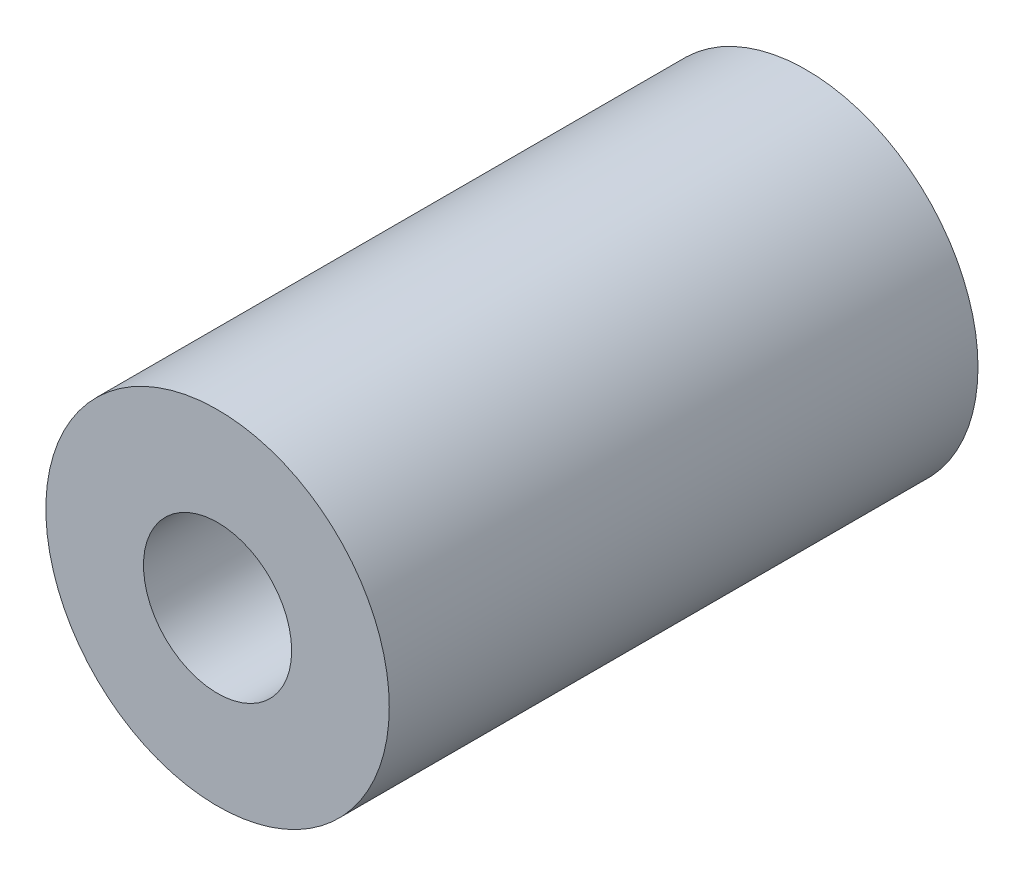
ISO-10303-21;
HEADER;
FILE_DESCRIPTION(('STEP AP214'),'2;1');
FILE_NAME('part.step','',(''),(''),'','','');
FILE_SCHEMA(('AUTOMOTIVE_DESIGN { 1 0 10303 214 1 1 1 1 }'));
ENDSEC;
DATA;
#1=APPLICATION_CONTEXT('core data for automotive mechanical design processes');
#2=APPLICATION_PROTOCOL_DEFINITION('international standard','automotive_design',2000,#1);
#3=PRODUCT_CONTEXT('',#1,'mechanical');
#4=PRODUCT('Part','Part','',(#3));
#5=PRODUCT_RELATED_PRODUCT_CATEGORY('part','',(#4));
#6=PRODUCT_DEFINITION_FORMATION('','',#4);
#7=PRODUCT_DEFINITION_CONTEXT('part definition',#1,'design');
#8=PRODUCT_DEFINITION('design','',#6,#7);
#9=PRODUCT_DEFINITION_SHAPE('','',#8);
#10=(LENGTH_UNIT() NAMED_UNIT(*) SI_UNIT(.MILLI.,.METRE.));
#11=(NAMED_UNIT(*) PLANE_ANGLE_UNIT() SI_UNIT($,.RADIAN.));
#12=(NAMED_UNIT(*) SI_UNIT($,.STERADIAN.) SOLID_ANGLE_UNIT());
#13=UNCERTAINTY_MEASURE_WITH_UNIT(LENGTH_MEASURE(1.E-05),#10,'distance_accuracy_value','');
#14=(GEOMETRIC_REPRESENTATION_CONTEXT(3) GLOBAL_UNCERTAINTY_ASSIGNED_CONTEXT((#13)) GLOBAL_UNIT_ASSIGNED_CONTEXT((#10,
#11,#12)) REPRESENTATION_CONTEXT('',''));
#15=CARTESIAN_POINT('',(0.,0.,0.));
#16=DIRECTION('',(0.,0.,1.));
#17=DIRECTION('',(1.,0.,0.));
#18=AXIS2_PLACEMENT_3D('',#15,#16,#17);
#19=CARTESIAN_POINT('',(0.,0.,30.));
#20=DIRECTION('',(0.,0.,-1.));
#21=DIRECTION('',(-1.,0.,0.));
#22=AXIS2_PLACEMENT_3D('',#19,#20,#21);
#23=CYLINDRICAL_SURFACE('',#22,17.5);
#24=CARTESIAN_POINT('',(0.,0.,30.));
#25=DIRECTION('',(0.,0.,1.));
#26=DIRECTION('',(1.,0.,0.));
#27=AXIS2_PLACEMENT_3D('',#24,#25,#26);
#28=CIRCLE('',#27,17.5);
#29=CARTESIAN_POINT('',(17.5,0.,30.));
#30=VERTEX_POINT('',#29);
#31=EDGE_CURVE('E10',#30,#30,#28,.T.);
#32=ORIENTED_EDGE('',*,*,#31,.F.);
#33=EDGE_LOOP('',(#32));
#34=FACE_BOUND('',#33,.T.);
#35=CARTESIAN_POINT('',(0.,0.,-30.));
#36=DIRECTION('',(0.,0.,1.));
#37=DIRECTION('',(1.,0.,0.));
#38=AXIS2_PLACEMENT_3D('',#35,#36,#37);
#39=CIRCLE('',#38,17.5);
#40=CARTESIAN_POINT('',(17.5,0.,-30.));
#41=VERTEX_POINT('',#40);
#42=EDGE_CURVE('E34',#41,#41,#39,.T.);
#43=ORIENTED_EDGE('',*,*,#42,.T.);
#44=EDGE_LOOP('',(#43));
#45=FACE_BOUND('',#44,.T.);
#46=ADVANCED_FACE('F31',(#34,#45),#23,.T.);
#47=CARTESIAN_POINT('',(0.,0.,30.));
#48=DIRECTION('',(0.,0.,1.));
#49=DIRECTION('',(1.,0.,0.));
#50=AXIS2_PLACEMENT_3D('',#47,#48,#49);
#51=PLANE('',#50);
#52=CARTESIAN_POINT('',(0.,0.,30.));
#53=DIRECTION('',(0.,0.,1.));
#54=DIRECTION('',(1.,0.,0.));
#55=AXIS2_PLACEMENT_3D('',#52,#53,#54);
#56=CIRCLE('',#55,7.55);
#57=CARTESIAN_POINT('',(7.55,0.,30.));
#58=VERTEX_POINT('',#57);
#59=EDGE_CURVE('E41',#58,#58,#56,.T.);
#60=ORIENTED_EDGE('',*,*,#59,.F.);
#61=EDGE_LOOP('',(#60));
#62=FACE_BOUND('',#61,.T.);
#63=ORIENTED_EDGE('',*,*,#31,.T.);
#64=EDGE_LOOP('',(#63));
#65=FACE_BOUND('',#64,.T.);
#66=ADVANCED_FACE('F62',(#62,#65),#51,.T.);
#67=CARTESIAN_POINT('',(0.,0.,-30.));
#68=DIRECTION('',(0.,0.,1.));
#69=DIRECTION('',(1.,0.,0.));
#70=AXIS2_PLACEMENT_3D('',#67,#68,#69);
#71=PLANE('',#70);
#72=CARTESIAN_POINT('',(0.,0.,-30.));
#73=DIRECTION('',(0.,0.,-1.));
#74=DIRECTION('',(-1.,0.,0.));
#75=AXIS2_PLACEMENT_3D('',#72,#73,#74);
#76=CIRCLE('',#75,10.05);
#77=CARTESIAN_POINT('',(-10.05,0.,-30.));
#78=VERTEX_POINT('',#77);
#79=EDGE_CURVE('E51',#78,#78,#76,.T.);
#80=ORIENTED_EDGE('',*,*,#79,.F.);
#81=EDGE_LOOP('',(#80));
#82=FACE_BOUND('',#81,.T.);
#83=ORIENTED_EDGE('',*,*,#42,.F.);
#84=EDGE_LOOP('',(#83));
#85=FACE_BOUND('',#84,.T.);
#86=ADVANCED_FACE('F58',(#82,#85),#71,.F.);
#87=CARTESIAN_POINT('',(0.,0.,-21.3546247918337));
#88=DIRECTION('',(0.,0.,1.));
#89=DIRECTION('',(1.,0.,0.));
#90=AXIS2_PLACEMENT_3D('',#87,#88,#89);
#91=CYLINDRICAL_SURFACE('',#90,7.55);
#92=CARTESIAN_POINT('',(0.,0.,0.));
#93=DIRECTION('',(0.,0.,1.));
#94=DIRECTION('',(1.,0.,0.));
#95=AXIS2_PLACEMENT_3D('',#92,#93,#94);
#96=CIRCLE('',#95,7.55);
#97=CARTESIAN_POINT('',(7.55,0.,0.));
#98=VERTEX_POINT('',#97);
#99=EDGE_CURVE('E45',#98,#98,#96,.F.);
#100=ORIENTED_EDGE('',*,*,#99,.T.);
#101=EDGE_LOOP('',(#100));
#102=FACE_BOUND('',#101,.T.);
#103=ORIENTED_EDGE('',*,*,#59,.T.);
#104=EDGE_LOOP('',(#103));
#105=FACE_BOUND('',#104,.T.);
#106=ADVANCED_FACE('F61',(#102,#105),#91,.F.);
#107=CARTESIAN_POINT('',(0.,0.,0.));
#108=DIRECTION('',(0.,0.,1.));
#109=DIRECTION('',(1.,0.,0.));
#110=AXIS2_PLACEMENT_3D('',#107,#108,#109);
#111=PLANE('',#110);
#112=CARTESIAN_POINT('',(0.,0.,0.));
#113=DIRECTION('',(0.,0.,1.));
#114=DIRECTION('',(1.,0.,0.));
#115=AXIS2_PLACEMENT_3D('',#112,#113,#114);
#116=CIRCLE('',#115,10.05);
#117=CARTESIAN_POINT('',(10.05,0.,0.));
#118=VERTEX_POINT('',#117);
#119=EDGE_CURVE('E48',#118,#118,#116,.F.);
#120=ORIENTED_EDGE('',*,*,#119,.T.);
#121=EDGE_LOOP('',(#120));
#122=FACE_BOUND('',#121,.T.);
#123=ORIENTED_EDGE('',*,*,#99,.F.);
#124=EDGE_LOOP('',(#123));
#125=FACE_BOUND('',#124,.T.);
#126=ADVANCED_FACE('F78',(#122,#125),#111,.F.);
#127=CARTESIAN_POINT('',(0.,0.,28.4256926036992));
#128=DIRECTION('',(0.,0.,-1.));
#129=DIRECTION('',(-1.,0.,0.));
#130=AXIS2_PLACEMENT_3D('',#127,#128,#129);
#131=CYLINDRICAL_SURFACE('',#130,10.05);
#132=ORIENTED_EDGE('',*,*,#79,.T.);
#133=EDGE_LOOP('',(#132));
#134=FACE_BOUND('',#133,.T.);
#135=ORIENTED_EDGE('',*,*,#119,.F.);
#136=EDGE_LOOP('',(#135));
#137=FACE_BOUND('',#136,.T.);
#138=ADVANCED_FACE('F55',(#134,#137),#131,.F.);
#139=CLOSED_SHELL('',(#46,#66,#86,#106,#126,#138));
#140=MANIFOLD_SOLID_BREP('B2',#139);
#141=ADVANCED_BREP_SHAPE_REPRESENTATION('',(#18,#140),#14);
#142=SHAPE_DEFINITION_REPRESENTATION(#9,#141);
ENDSEC;
END-ISO-10303-21;
